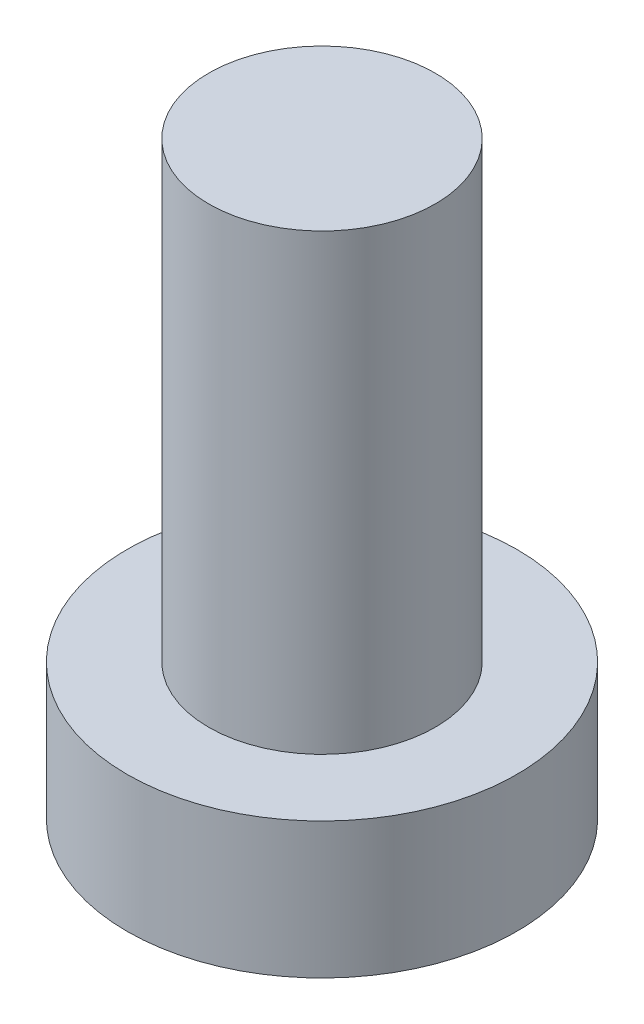
ISO-10303-21;
HEADER;
FILE_DESCRIPTION(('STEP AP214'),'2;1');
FILE_NAME('part.step','',(''),(''),'','','');
FILE_SCHEMA(('AUTOMOTIVE_DESIGN { 1 0 10303 214 1 1 1 1 }'));
ENDSEC;
DATA;
#1=APPLICATION_CONTEXT('core data for automotive mechanical design processes');
#2=APPLICATION_PROTOCOL_DEFINITION('international standard','automotive_design',2000,#1);
#3=PRODUCT_CONTEXT('',#1,'mechanical');
#4=PRODUCT('Part','Part','',(#3));
#5=PRODUCT_RELATED_PRODUCT_CATEGORY('part','',(#4));
#6=PRODUCT_DEFINITION_FORMATION('','',#4);
#7=PRODUCT_DEFINITION_CONTEXT('part definition',#1,'design');
#8=PRODUCT_DEFINITION('design','',#6,#7);
#9=PRODUCT_DEFINITION_SHAPE('','',#8);
#10=(LENGTH_UNIT() NAMED_UNIT(*) SI_UNIT(.MILLI.,.METRE.));
#11=(NAMED_UNIT(*) PLANE_ANGLE_UNIT() SI_UNIT($,.RADIAN.));
#12=(NAMED_UNIT(*) SI_UNIT($,.STERADIAN.) SOLID_ANGLE_UNIT());
#13=UNCERTAINTY_MEASURE_WITH_UNIT(LENGTH_MEASURE(1.E-05),#10,'distance_accuracy_value','');
#14=(GEOMETRIC_REPRESENTATION_CONTEXT(3) GLOBAL_UNCERTAINTY_ASSIGNED_CONTEXT((#13)) GLOBAL_UNIT_ASSIGNED_CONTEXT((#10,
#11,#12)) REPRESENTATION_CONTEXT('',''));
#15=CARTESIAN_POINT('',(0.,0.,0.));
#16=DIRECTION('',(0.,0.,1.));
#17=DIRECTION('',(1.,0.,0.));
#18=AXIS2_PLACEMENT_3D('',#15,#16,#17);
#19=CARTESIAN_POINT('',(0.,0.,0.));
#20=DIRECTION('',(0.,1.,0.));
#21=DIRECTION('',(0.,0.,1.));
#22=AXIS2_PLACEMENT_3D('',#19,#20,#21);
#23=PLANE('',#22);
#24=CARTESIAN_POINT('',(0.,0.,0.));
#25=DIRECTION('',(0.,1.,0.));
#26=DIRECTION('',(0.,0.,1.));
#27=AXIS2_PLACEMENT_3D('',#24,#25,#26);
#28=CIRCLE('',#27,4.3);
#29=CARTESIAN_POINT('',(0.,0.,4.3));
#30=VERTEX_POINT('',#29);
#31=EDGE_CURVE('E39',#30,#30,#28,.T.);
#32=ORIENTED_EDGE('',*,*,#31,.F.);
#33=EDGE_LOOP('',(#32));
#34=FACE_BOUND('',#33,.T.);
#35=CARTESIAN_POINT('',(1.1,0.,1.1));
#36=DIRECTION('',(0.,1.,0.));
#37=DIRECTION('',(0.,0.,-1.));
#38=AXIS2_PLACEMENT_3D('',#35,#36,#37);
#39=CIRCLE('',#38,0.5);
#40=CARTESIAN_POINT('',(1.1,0.,0.6));
#41=VERTEX_POINT('',#40);
#42=CARTESIAN_POINT('',(0.6,0.,1.1));
#43=VERTEX_POINT('',#42);
#44=EDGE_CURVE('E186',#41,#43,#39,.T.);
#45=ORIENTED_EDGE('',*,*,#44,.F.);
#46=DIRECTION('',(-1.,0.,0.));
#47=VECTOR('',#46,1.);
#48=CARTESIAN_POINT('',(1.1,0.,0.6));
#49=LINE('',#48,#47);
#50=CARTESIAN_POINT('',(2.4,0.,0.6));
#51=VERTEX_POINT('',#50);
#52=EDGE_CURVE('E52',#51,#41,#49,.T.);
#53=ORIENTED_EDGE('',*,*,#52,.F.);
#54=DIRECTION('',(0.,0.,1.));
#55=VECTOR('',#54,1.);
#56=CARTESIAN_POINT('',(2.4,0.,-0.6));
#57=LINE('',#56,#55);
#58=CARTESIAN_POINT('',(2.4,0.,-0.6));
#59=VERTEX_POINT('',#58);
#60=EDGE_CURVE('E225',#59,#51,#57,.T.);
#61=ORIENTED_EDGE('',*,*,#60,.F.);
#62=DIRECTION('',(1.,0.,0.));
#63=VECTOR('',#62,1.);
#64=CARTESIAN_POINT('',(1.1,0.,-0.6));
#65=LINE('',#64,#63);
#66=CARTESIAN_POINT('',(1.1,0.,-0.6));
#67=VERTEX_POINT('',#66);
#68=EDGE_CURVE('E223',#67,#59,#65,.T.);
#69=ORIENTED_EDGE('',*,*,#68,.F.);
#70=CARTESIAN_POINT('',(1.1,0.,-1.1));
#71=DIRECTION('',(0.,1.,0.));
#72=DIRECTION('',(0.,0.,-1.));
#73=AXIS2_PLACEMENT_3D('',#70,#71,#72);
#74=CIRCLE('',#73,0.5);
#75=CARTESIAN_POINT('',(0.600000000000001,0.,-1.1));
#76=VERTEX_POINT('',#75);
#77=EDGE_CURVE('E160',#76,#67,#74,.T.);
#78=ORIENTED_EDGE('',*,*,#77,.F.);
#79=DIRECTION('',(0.,0.,1.));
#80=VECTOR('',#79,1.);
#81=CARTESIAN_POINT('',(0.600000000000001,0.,-2.4));
#82=LINE('',#81,#80);
#83=CARTESIAN_POINT('',(0.600000000000001,0.,-2.4));
#84=VERTEX_POINT('',#83);
#85=EDGE_CURVE('E219',#84,#76,#82,.T.);
#86=ORIENTED_EDGE('',*,*,#85,.F.);
#87=DIRECTION('',(1.,0.,0.));
#88=VECTOR('',#87,1.);
#89=CARTESIAN_POINT('',(-0.599999999999999,0.,-2.4));
#90=LINE('',#89,#88);
#91=CARTESIAN_POINT('',(-0.599999999999999,0.,-2.4));
#92=VERTEX_POINT('',#91);
#93=EDGE_CURVE('E216',#92,#84,#90,.T.);
#94=ORIENTED_EDGE('',*,*,#93,.F.);
#95=DIRECTION('',(0.,0.,-1.));
#96=VECTOR('',#95,1.);
#97=CARTESIAN_POINT('',(-0.599999999999999,0.,-2.4));
#98=LINE('',#97,#96);
#99=CARTESIAN_POINT('',(-0.599999999999999,0.,-1.1));
#100=VERTEX_POINT('',#99);
#101=EDGE_CURVE('E213',#100,#92,#98,.T.);
#102=ORIENTED_EDGE('',*,*,#101,.F.);
#103=CARTESIAN_POINT('',(-1.1,0.,-1.1));
#104=DIRECTION('',(0.,1.,0.));
#105=DIRECTION('',(0.,0.,-1.));
#106=AXIS2_PLACEMENT_3D('',#103,#104,#105);
#107=CIRCLE('',#106,0.5);
#108=CARTESIAN_POINT('',(-1.1,0.,-0.6));
#109=VERTEX_POINT('',#108);
#110=EDGE_CURVE('E210',#109,#100,#107,.T.);
#111=ORIENTED_EDGE('',*,*,#110,.F.);
#112=DIRECTION('',(1.,0.,0.));
#113=VECTOR('',#112,1.);
#114=CARTESIAN_POINT('',(-2.4,0.,-0.6));
#115=LINE('',#114,#113);
#116=CARTESIAN_POINT('',(-2.4,0.,-0.6));
#117=VERTEX_POINT('',#116);
#118=EDGE_CURVE('E207',#117,#109,#115,.T.);
#119=ORIENTED_EDGE('',*,*,#118,.F.);
#120=DIRECTION('',(0.,0.,-1.));
#121=VECTOR('',#120,1.);
#122=CARTESIAN_POINT('',(-2.4,0.,-0.6));
#123=LINE('',#122,#121);
#124=CARTESIAN_POINT('',(-2.4,0.,0.6));
#125=VERTEX_POINT('',#124);
#126=EDGE_CURVE('E204',#125,#117,#123,.T.);
#127=ORIENTED_EDGE('',*,*,#126,.F.);
#128=DIRECTION('',(-1.,0.,0.));
#129=VECTOR('',#128,1.);
#130=CARTESIAN_POINT('',(-2.4,0.,0.6));
#131=LINE('',#130,#129);
#132=CARTESIAN_POINT('',(-1.1,0.,0.6));
#133=VERTEX_POINT('',#132);
#134=EDGE_CURVE('E201',#133,#125,#131,.T.);
#135=ORIENTED_EDGE('',*,*,#134,.F.);
#136=CARTESIAN_POINT('',(-1.1,0.,1.1));
#137=DIRECTION('',(0.,1.,0.));
#138=DIRECTION('',(0.,0.,1.));
#139=AXIS2_PLACEMENT_3D('',#136,#137,#138);
#140=CIRCLE('',#139,0.5);
#141=CARTESIAN_POINT('',(-0.599999999999999,0.,1.1));
#142=VERTEX_POINT('',#141);
#143=EDGE_CURVE('E198',#142,#133,#140,.T.);
#144=ORIENTED_EDGE('',*,*,#143,.F.);
#145=DIRECTION('',(0.,0.,-1.));
#146=VECTOR('',#145,1.);
#147=CARTESIAN_POINT('',(-0.599999999999999,0.,1.1));
#148=LINE('',#147,#146);
#149=CARTESIAN_POINT('',(-0.599999999999999,0.,2.4));
#150=VERTEX_POINT('',#149);
#151=EDGE_CURVE('E195',#150,#142,#148,.T.);
#152=ORIENTED_EDGE('',*,*,#151,.F.);
#153=DIRECTION('',(-1.,0.,0.));
#154=VECTOR('',#153,1.);
#155=CARTESIAN_POINT('',(-0.599999999999999,0.,2.4));
#156=LINE('',#155,#154);
#157=CARTESIAN_POINT('',(0.600000000000001,0.,2.4));
#158=VERTEX_POINT('',#157);
#159=EDGE_CURVE('E192',#158,#150,#156,.T.);
#160=ORIENTED_EDGE('',*,*,#159,.F.);
#161=DIRECTION('',(0.,0.,1.));
#162=VECTOR('',#161,1.);
#163=CARTESIAN_POINT('',(0.6,0.,1.1));
#164=LINE('',#163,#162);
#165=EDGE_CURVE('E189',#43,#158,#164,.T.);
#166=ORIENTED_EDGE('',*,*,#165,.F.);
#167=EDGE_LOOP('',(#45,#53,#61,#69,#78,#86,#94,#102,#111,#119,#127,#135,#144,#152,#160,#166));
#168=FACE_BOUND('',#167,.T.);
#169=ADVANCED_FACE('F35',(#34,#168),#23,.F.);
#170=CARTESIAN_POINT('',(0.,3.,0.));
#171=DIRECTION('',(0.,-1.,0.));
#172=DIRECTION('',(0.,0.,-1.));
#173=AXIS2_PLACEMENT_3D('',#170,#171,#172);
#174=CYLINDRICAL_SURFACE('',#173,4.3);
#175=CARTESIAN_POINT('',(0.,3.,0.));
#176=DIRECTION('',(0.,1.,0.));
#177=DIRECTION('',(0.,0.,1.));
#178=AXIS2_PLACEMENT_3D('',#175,#176,#177);
#179=CIRCLE('',#178,4.3);
#180=CARTESIAN_POINT('',(0.,3.,4.3));
#181=VERTEX_POINT('',#180);
#182=EDGE_CURVE('E44',#181,#181,#179,.T.);
#183=ORIENTED_EDGE('',*,*,#182,.F.);
#184=EDGE_LOOP('',(#183));
#185=FACE_BOUND('',#184,.T.);
#186=ORIENTED_EDGE('',*,*,#31,.T.);
#187=EDGE_LOOP('',(#186));
#188=FACE_BOUND('',#187,.T.);
#189=ADVANCED_FACE('F37',(#185,#188),#174,.T.);
#190=CARTESIAN_POINT('',(0.,3.,0.));
#191=DIRECTION('',(0.,1.,0.));
#192=DIRECTION('',(0.,0.,1.));
#193=AXIS2_PLACEMENT_3D('',#190,#191,#192);
#194=PLANE('',#193);
#195=CARTESIAN_POINT('',(0.,3.,0.));
#196=DIRECTION('',(0.,1.,0.));
#197=DIRECTION('',(0.,0.,1.));
#198=AXIS2_PLACEMENT_3D('',#195,#196,#197);
#199=CIRCLE('',#198,2.5);
#200=CARTESIAN_POINT('',(0.,3.,2.5));
#201=VERTEX_POINT('',#200);
#202=EDGE_CURVE('E11',#201,#201,#199,.T.);
#203=ORIENTED_EDGE('',*,*,#202,.F.);
#204=EDGE_LOOP('',(#203));
#205=FACE_BOUND('',#204,.T.);
#206=ORIENTED_EDGE('',*,*,#182,.T.);
#207=EDGE_LOOP('',(#206));
#208=FACE_BOUND('',#207,.T.);
#209=ADVANCED_FACE('F374',(#205,#208),#194,.T.);
#210=CARTESIAN_POINT('',(0.,13.,0.));
#211=DIRECTION('',(0.,-1.,0.));
#212=DIRECTION('',(0.,0.,-1.));
#213=AXIS2_PLACEMENT_3D('',#210,#211,#212);
#214=CYLINDRICAL_SURFACE('',#213,2.5);
#215=CARTESIAN_POINT('',(0.,13.,0.));
#216=DIRECTION('',(0.,1.,0.));
#217=DIRECTION('',(0.,0.,1.));
#218=AXIS2_PLACEMENT_3D('',#215,#216,#217);
#219=CIRCLE('',#218,2.5);
#220=CARTESIAN_POINT('',(0.,13.,2.5));
#221=VERTEX_POINT('',#220);
#222=EDGE_CURVE('E229',#221,#221,#219,.T.);
#223=ORIENTED_EDGE('',*,*,#222,.F.);
#224=EDGE_LOOP('',(#223));
#225=FACE_BOUND('',#224,.T.);
#226=ORIENTED_EDGE('',*,*,#202,.T.);
#227=EDGE_LOOP('',(#226));
#228=FACE_BOUND('',#227,.T.);
#229=ADVANCED_FACE('F370',(#225,#228),#214,.T.);
#230=CARTESIAN_POINT('',(0.,13.,0.));
#231=DIRECTION('',(0.,1.,0.));
#232=DIRECTION('',(0.,0.,1.));
#233=AXIS2_PLACEMENT_3D('',#230,#231,#232);
#234=PLANE('',#233);
#235=ORIENTED_EDGE('',*,*,#222,.T.);
#236=EDGE_LOOP('',(#235));
#237=FACE_BOUND('',#236,.T.);
#238=ADVANCED_FACE('F320',(#237),#234,.T.);
#239=CARTESIAN_POINT('',(1.1,1.5,0.6));
#240=DIRECTION('',(0.,0.,1.));
#241=DIRECTION('',(1.,0.,0.));
#242=AXIS2_PLACEMENT_3D('',#239,#240,#241);
#243=PLANE('',#242);
#244=ORIENTED_EDGE('',*,*,#52,.T.);
#245=DIRECTION('',(0.,-1.,0.));
#246=VECTOR('',#245,1.);
#247=CARTESIAN_POINT('',(1.1,1.5,0.6));
#248=LINE('',#247,#246);
#249=CARTESIAN_POINT('',(1.1,1.5,0.6));
#250=VERTEX_POINT('',#249);
#251=EDGE_CURVE('E112',#250,#41,#248,.T.);
#252=ORIENTED_EDGE('',*,*,#251,.F.);
#253=DIRECTION('',(-1.,0.,0.));
#254=VECTOR('',#253,1.);
#255=CARTESIAN_POINT('',(1.1,1.5,0.6));
#256=LINE('',#255,#254);
#257=CARTESIAN_POINT('',(2.4,1.5,0.6));
#258=VERTEX_POINT('',#257);
#259=EDGE_CURVE('E227',#258,#250,#256,.T.);
#260=ORIENTED_EDGE('',*,*,#259,.F.);
#261=DIRECTION('',(0.,-1.,0.));
#262=VECTOR('',#261,1.);
#263=CARTESIAN_POINT('',(2.4,1.5,0.6));
#264=LINE('',#263,#262);
#265=EDGE_CURVE('E60',#258,#51,#264,.T.);
#266=ORIENTED_EDGE('',*,*,#265,.T.);
#267=EDGE_LOOP('',(#244,#252,#260,#266));
#268=FACE_BOUND('',#267,.T.);
#269=ADVANCED_FACE('F313',(#268),#243,.F.);
#270=CARTESIAN_POINT('',(2.4,1.5,-0.6));
#271=DIRECTION('',(1.,0.,0.));
#272=DIRECTION('',(0.,0.,-1.));
#273=AXIS2_PLACEMENT_3D('',#270,#271,#272);
#274=PLANE('',#273);
#275=ORIENTED_EDGE('',*,*,#60,.T.);
#276=ORIENTED_EDGE('',*,*,#265,.F.);
#277=DIRECTION('',(0.,0.,1.));
#278=VECTOR('',#277,1.);
#279=CARTESIAN_POINT('',(2.4,1.5,-0.6));
#280=LINE('',#279,#278);
#281=CARTESIAN_POINT('',(2.4,1.5,-0.6));
#282=VERTEX_POINT('',#281);
#283=EDGE_CURVE('E172',#282,#258,#280,.T.);
#284=ORIENTED_EDGE('',*,*,#283,.F.);
#285=DIRECTION('',(0.,-1.,0.));
#286=VECTOR('',#285,1.);
#287=CARTESIAN_POINT('',(2.4,1.5,-0.6));
#288=LINE('',#287,#286);
#289=EDGE_CURVE('E164',#282,#59,#288,.T.);
#290=ORIENTED_EDGE('',*,*,#289,.T.);
#291=EDGE_LOOP('',(#275,#276,#284,#290));
#292=FACE_BOUND('',#291,.T.);
#293=ADVANCED_FACE('F311',(#292),#274,.F.);
#294=CARTESIAN_POINT('',(1.1,1.5,-0.6));
#295=DIRECTION('',(0.,0.,-1.));
#296=DIRECTION('',(-1.,0.,0.));
#297=AXIS2_PLACEMENT_3D('',#294,#295,#296);
#298=PLANE('',#297);
#299=ORIENTED_EDGE('',*,*,#68,.T.);
#300=ORIENTED_EDGE('',*,*,#289,.F.);
#301=DIRECTION('',(1.,0.,0.));
#302=VECTOR('',#301,1.);
#303=CARTESIAN_POINT('',(1.1,1.5,-0.6));
#304=LINE('',#303,#302);
#305=CARTESIAN_POINT('',(1.1,1.5,-0.6));
#306=VERTEX_POINT('',#305);
#307=EDGE_CURVE('E168',#306,#282,#304,.T.);
#308=ORIENTED_EDGE('',*,*,#307,.F.);
#309=DIRECTION('',(0.,-1.,0.));
#310=VECTOR('',#309,1.);
#311=CARTESIAN_POINT('',(1.1,1.5,-0.6));
#312=LINE('',#311,#310);
#313=EDGE_CURVE('E153',#306,#67,#312,.T.);
#314=ORIENTED_EDGE('',*,*,#313,.T.);
#315=EDGE_LOOP('',(#299,#300,#308,#314));
#316=FACE_BOUND('',#315,.T.);
#317=ADVANCED_FACE('F169',(#316),#298,.F.);
#318=CARTESIAN_POINT('',(1.1,1.5,-1.1));
#319=DIRECTION('',(0.,-1.,0.));
#320=DIRECTION('',(0.,0.,-1.));
#321=AXIS2_PLACEMENT_3D('',#318,#319,#320);
#322=CYLINDRICAL_SURFACE('',#321,0.5);
#323=ORIENTED_EDGE('',*,*,#77,.T.);
#324=ORIENTED_EDGE('',*,*,#313,.F.);
#325=CARTESIAN_POINT('',(1.1,1.5,-1.1));
#326=DIRECTION('',(0.,1.,0.));
#327=DIRECTION('',(0.,0.,-1.));
#328=AXIS2_PLACEMENT_3D('',#325,#326,#327);
#329=CIRCLE('',#328,0.5);
#330=CARTESIAN_POINT('',(0.600000000000001,1.5,-1.1));
#331=VERTEX_POINT('',#330);
#332=EDGE_CURVE('E157',#331,#306,#329,.T.);
#333=ORIENTED_EDGE('',*,*,#332,.F.);
#334=DIRECTION('',(0.,-1.,0.));
#335=VECTOR('',#334,1.);
#336=CARTESIAN_POINT('',(0.600000000000001,1.5,-1.1));
#337=LINE('',#336,#335);
#338=EDGE_CURVE('E165',#331,#76,#337,.T.);
#339=ORIENTED_EDGE('',*,*,#338,.T.);
#340=EDGE_LOOP('',(#323,#324,#333,#339));
#341=FACE_BOUND('',#340,.T.);
#342=ADVANCED_FACE('F155',(#341),#322,.T.);
#343=CARTESIAN_POINT('',(0.600000000000001,1.5,-2.4));
#344=DIRECTION('',(1.,0.,0.));
#345=DIRECTION('',(0.,0.,-1.));
#346=AXIS2_PLACEMENT_3D('',#343,#344,#345);
#347=PLANE('',#346);
#348=ORIENTED_EDGE('',*,*,#85,.T.);
#349=ORIENTED_EDGE('',*,*,#338,.F.);
#350=DIRECTION('',(0.,0.,1.));
#351=VECTOR('',#350,1.);
#352=CARTESIAN_POINT('',(0.600000000000001,1.5,-2.4));
#353=LINE('',#352,#351);
#354=CARTESIAN_POINT('',(0.600000000000001,1.5,-2.4));
#355=VERTEX_POINT('',#354);
#356=EDGE_CURVE('E178',#355,#331,#353,.T.);
#357=ORIENTED_EDGE('',*,*,#356,.F.);
#358=DIRECTION('',(0.,-1.,0.));
#359=VECTOR('',#358,1.);
#360=CARTESIAN_POINT('',(0.600000000000001,1.5,-2.4));
#361=LINE('',#360,#359);
#362=EDGE_CURVE('E232',#355,#84,#361,.T.);
#363=ORIENTED_EDGE('',*,*,#362,.T.);
#364=EDGE_LOOP('',(#348,#349,#357,#363));
#365=FACE_BOUND('',#364,.T.);
#366=ADVANCED_FACE('F310',(#365),#347,.F.);
#367=CARTESIAN_POINT('',(-0.599999999999999,1.5,-2.4));
#368=DIRECTION('',(0.,0.,-1.));
#369=DIRECTION('',(-1.,0.,0.));
#370=AXIS2_PLACEMENT_3D('',#367,#368,#369);
#371=PLANE('',#370);
#372=ORIENTED_EDGE('',*,*,#93,.T.);
#373=ORIENTED_EDGE('',*,*,#362,.F.);
#374=DIRECTION('',(1.,0.,0.));
#375=VECTOR('',#374,1.);
#376=CARTESIAN_POINT('',(-0.599999999999999,1.5,-2.4));
#377=LINE('',#376,#375);
#378=CARTESIAN_POINT('',(-0.599999999999999,1.5,-2.4));
#379=VERTEX_POINT('',#378);
#380=EDGE_CURVE('E180',#379,#355,#377,.T.);
#381=ORIENTED_EDGE('',*,*,#380,.F.);
#382=DIRECTION('',(0.,-1.,0.));
#383=VECTOR('',#382,1.);
#384=CARTESIAN_POINT('',(-0.599999999999999,1.5,-2.4));
#385=LINE('',#384,#383);
#386=EDGE_CURVE('E234',#379,#92,#385,.T.);
#387=ORIENTED_EDGE('',*,*,#386,.T.);
#388=EDGE_LOOP('',(#372,#373,#381,#387));
#389=FACE_BOUND('',#388,.T.);
#390=ADVANCED_FACE('F306',(#389),#371,.F.);
#391=CARTESIAN_POINT('',(-0.599999999999999,1.5,-2.4));
#392=DIRECTION('',(-1.,0.,0.));
#393=DIRECTION('',(0.,0.,1.));
#394=AXIS2_PLACEMENT_3D('',#391,#392,#393);
#395=PLANE('',#394);
#396=ORIENTED_EDGE('',*,*,#101,.T.);
#397=ORIENTED_EDGE('',*,*,#386,.F.);
#398=DIRECTION('',(0.,0.,-1.));
#399=VECTOR('',#398,1.);
#400=CARTESIAN_POINT('',(-0.599999999999999,1.5,-2.4));
#401=LINE('',#400,#399);
#402=CARTESIAN_POINT('',(-0.599999999999999,1.5,-1.1));
#403=VERTEX_POINT('',#402);
#404=EDGE_CURVE('E301',#403,#379,#401,.T.);
#405=ORIENTED_EDGE('',*,*,#404,.F.);
#406=DIRECTION('',(0.,-1.,0.));
#407=VECTOR('',#406,1.);
#408=CARTESIAN_POINT('',(-0.599999999999999,1.5,-1.1));
#409=LINE('',#408,#407);
#410=EDGE_CURVE('E236',#403,#100,#409,.T.);
#411=ORIENTED_EDGE('',*,*,#410,.T.);
#412=EDGE_LOOP('',(#396,#397,#405,#411));
#413=FACE_BOUND('',#412,.T.);
#414=ADVANCED_FACE('F330',(#413),#395,.F.);
#415=CARTESIAN_POINT('',(-1.1,1.5,-1.1));
#416=DIRECTION('',(0.,-1.,0.));
#417=DIRECTION('',(0.,0.,-1.));
#418=AXIS2_PLACEMENT_3D('',#415,#416,#417);
#419=CYLINDRICAL_SURFACE('',#418,0.5);
#420=ORIENTED_EDGE('',*,*,#110,.T.);
#421=ORIENTED_EDGE('',*,*,#410,.F.);
#422=CARTESIAN_POINT('',(-1.1,1.5,-1.1));
#423=DIRECTION('',(0.,1.,0.));
#424=DIRECTION('',(0.,0.,-1.));
#425=AXIS2_PLACEMENT_3D('',#422,#423,#424);
#426=CIRCLE('',#425,0.5);
#427=CARTESIAN_POINT('',(-1.1,1.5,-0.6));
#428=VERTEX_POINT('',#427);
#429=EDGE_CURVE('E298',#428,#403,#426,.T.);
#430=ORIENTED_EDGE('',*,*,#429,.F.);
#431=DIRECTION('',(0.,-1.,0.));
#432=VECTOR('',#431,1.);
#433=CARTESIAN_POINT('',(-1.1,1.5,-0.6));
#434=LINE('',#433,#432);
#435=EDGE_CURVE('E238',#428,#109,#434,.T.);
#436=ORIENTED_EDGE('',*,*,#435,.T.);
#437=EDGE_LOOP('',(#420,#421,#430,#436));
#438=FACE_BOUND('',#437,.T.);
#439=ADVANCED_FACE('F333',(#438),#419,.T.);
#440=CARTESIAN_POINT('',(-2.4,1.5,-0.6));
#441=DIRECTION('',(0.,0.,-1.));
#442=DIRECTION('',(-1.,0.,0.));
#443=AXIS2_PLACEMENT_3D('',#440,#441,#442);
#444=PLANE('',#443);
#445=ORIENTED_EDGE('',*,*,#118,.T.);
#446=ORIENTED_EDGE('',*,*,#435,.F.);
#447=DIRECTION('',(1.,0.,0.));
#448=VECTOR('',#447,1.);
#449=CARTESIAN_POINT('',(-2.4,1.5,-0.6));
#450=LINE('',#449,#448);
#451=CARTESIAN_POINT('',(-2.4,1.5,-0.6));
#452=VERTEX_POINT('',#451);
#453=EDGE_CURVE('E295',#452,#428,#450,.T.);
#454=ORIENTED_EDGE('',*,*,#453,.F.);
#455=DIRECTION('',(0.,-1.,0.));
#456=VECTOR('',#455,1.);
#457=CARTESIAN_POINT('',(-2.4,1.5,-0.6));
#458=LINE('',#457,#456);
#459=EDGE_CURVE('E240',#452,#117,#458,.T.);
#460=ORIENTED_EDGE('',*,*,#459,.T.);
#461=EDGE_LOOP('',(#445,#446,#454,#460));
#462=FACE_BOUND('',#461,.T.);
#463=ADVANCED_FACE('F337',(#462),#444,.F.);
#464=CARTESIAN_POINT('',(-2.4,1.5,-0.6));
#465=DIRECTION('',(-1.,0.,0.));
#466=DIRECTION('',(0.,0.,1.));
#467=AXIS2_PLACEMENT_3D('',#464,#465,#466);
#468=PLANE('',#467);
#469=ORIENTED_EDGE('',*,*,#126,.T.);
#470=ORIENTED_EDGE('',*,*,#459,.F.);
#471=DIRECTION('',(0.,0.,-1.));
#472=VECTOR('',#471,1.);
#473=CARTESIAN_POINT('',(-2.4,1.5,-0.6));
#474=LINE('',#473,#472);
#475=CARTESIAN_POINT('',(-2.4,1.5,0.6));
#476=VERTEX_POINT('',#475);
#477=EDGE_CURVE('E292',#476,#452,#474,.T.);
#478=ORIENTED_EDGE('',*,*,#477,.F.);
#479=DIRECTION('',(0.,-1.,0.));
#480=VECTOR('',#479,1.);
#481=CARTESIAN_POINT('',(-2.4,1.5,0.6));
#482=LINE('',#481,#480);
#483=EDGE_CURVE('E242',#476,#125,#482,.T.);
#484=ORIENTED_EDGE('',*,*,#483,.T.);
#485=EDGE_LOOP('',(#469,#470,#478,#484));
#486=FACE_BOUND('',#485,.T.);
#487=ADVANCED_FACE('F341',(#486),#468,.F.);
#488=CARTESIAN_POINT('',(-2.4,1.5,0.6));
#489=DIRECTION('',(0.,0.,1.));
#490=DIRECTION('',(1.,0.,0.));
#491=AXIS2_PLACEMENT_3D('',#488,#489,#490);
#492=PLANE('',#491);
#493=ORIENTED_EDGE('',*,*,#134,.T.);
#494=ORIENTED_EDGE('',*,*,#483,.F.);
#495=DIRECTION('',(-1.,0.,0.));
#496=VECTOR('',#495,1.);
#497=CARTESIAN_POINT('',(-2.4,1.5,0.6));
#498=LINE('',#497,#496);
#499=CARTESIAN_POINT('',(-1.1,1.5,0.6));
#500=VERTEX_POINT('',#499);
#501=EDGE_CURVE('E289',#500,#476,#498,.T.);
#502=ORIENTED_EDGE('',*,*,#501,.F.);
#503=DIRECTION('',(0.,-1.,0.));
#504=VECTOR('',#503,1.);
#505=CARTESIAN_POINT('',(-1.1,1.5,0.6));
#506=LINE('',#505,#504);
#507=EDGE_CURVE('E244',#500,#133,#506,.T.);
#508=ORIENTED_EDGE('',*,*,#507,.T.);
#509=EDGE_LOOP('',(#493,#494,#502,#508));
#510=FACE_BOUND('',#509,.T.);
#511=ADVANCED_FACE('F345',(#510),#492,.F.);
#512=CARTESIAN_POINT('',(-1.1,1.5,1.1));
#513=DIRECTION('',(0.,-1.,0.));
#514=DIRECTION('',(0.,0.,-1.));
#515=AXIS2_PLACEMENT_3D('',#512,#513,#514);
#516=CYLINDRICAL_SURFACE('',#515,0.5);
#517=ORIENTED_EDGE('',*,*,#143,.T.);
#518=ORIENTED_EDGE('',*,*,#507,.F.);
#519=CARTESIAN_POINT('',(-1.1,1.5,1.1));
#520=DIRECTION('',(0.,1.,0.));
#521=DIRECTION('',(0.,0.,1.));
#522=AXIS2_PLACEMENT_3D('',#519,#520,#521);
#523=CIRCLE('',#522,0.5);
#524=CARTESIAN_POINT('',(-0.599999999999999,1.5,1.1));
#525=VERTEX_POINT('',#524);
#526=EDGE_CURVE('E286',#525,#500,#523,.T.);
#527=ORIENTED_EDGE('',*,*,#526,.F.);
#528=DIRECTION('',(0.,-1.,0.));
#529=VECTOR('',#528,1.);
#530=CARTESIAN_POINT('',(-0.599999999999999,1.5,1.1));
#531=LINE('',#530,#529);
#532=EDGE_CURVE('E246',#525,#142,#531,.T.);
#533=ORIENTED_EDGE('',*,*,#532,.T.);
#534=EDGE_LOOP('',(#517,#518,#527,#533));
#535=FACE_BOUND('',#534,.T.);
#536=ADVANCED_FACE('F349',(#535),#516,.T.);
#537=CARTESIAN_POINT('',(-0.599999999999999,1.5,1.1));
#538=DIRECTION('',(-1.,0.,0.));
#539=DIRECTION('',(0.,0.,1.));
#540=AXIS2_PLACEMENT_3D('',#537,#538,#539);
#541=PLANE('',#540);
#542=ORIENTED_EDGE('',*,*,#151,.T.);
#543=ORIENTED_EDGE('',*,*,#532,.F.);
#544=DIRECTION('',(0.,0.,-1.));
#545=VECTOR('',#544,1.);
#546=CARTESIAN_POINT('',(-0.599999999999999,1.5,1.1));
#547=LINE('',#546,#545);
#548=CARTESIAN_POINT('',(-0.599999999999999,1.5,2.4));
#549=VERTEX_POINT('',#548);
#550=EDGE_CURVE('E283',#549,#525,#547,.T.);
#551=ORIENTED_EDGE('',*,*,#550,.F.);
#552=DIRECTION('',(0.,-1.,0.));
#553=VECTOR('',#552,1.);
#554=CARTESIAN_POINT('',(-0.599999999999999,1.5,2.4));
#555=LINE('',#554,#553);
#556=EDGE_CURVE('E248',#549,#150,#555,.T.);
#557=ORIENTED_EDGE('',*,*,#556,.T.);
#558=EDGE_LOOP('',(#542,#543,#551,#557));
#559=FACE_BOUND('',#558,.T.);
#560=ADVANCED_FACE('F353',(#559),#541,.F.);
#561=CARTESIAN_POINT('',(-0.599999999999999,1.5,2.4));
#562=DIRECTION('',(0.,0.,1.));
#563=DIRECTION('',(1.,0.,0.));
#564=AXIS2_PLACEMENT_3D('',#561,#562,#563);
#565=PLANE('',#564);
#566=ORIENTED_EDGE('',*,*,#159,.T.);
#567=ORIENTED_EDGE('',*,*,#556,.F.);
#568=DIRECTION('',(-1.,0.,0.));
#569=VECTOR('',#568,1.);
#570=CARTESIAN_POINT('',(-0.599999999999999,1.5,2.4));
#571=LINE('',#570,#569);
#572=CARTESIAN_POINT('',(0.600000000000001,1.5,2.4));
#573=VERTEX_POINT('',#572);
#574=EDGE_CURVE('E280',#573,#549,#571,.T.);
#575=ORIENTED_EDGE('',*,*,#574,.F.);
#576=DIRECTION('',(0.,-1.,0.));
#577=VECTOR('',#576,1.);
#578=CARTESIAN_POINT('',(0.600000000000001,1.5,2.4));
#579=LINE('',#578,#577);
#580=EDGE_CURVE('E250',#573,#158,#579,.T.);
#581=ORIENTED_EDGE('',*,*,#580,.T.);
#582=EDGE_LOOP('',(#566,#567,#575,#581));
#583=FACE_BOUND('',#582,.T.);
#584=ADVANCED_FACE('F357',(#583),#565,.F.);
#585=CARTESIAN_POINT('',(0.6,1.5,1.1));
#586=DIRECTION('',(1.,0.,0.));
#587=DIRECTION('',(0.,0.,-1.));
#588=AXIS2_PLACEMENT_3D('',#585,#586,#587);
#589=PLANE('',#588);
#590=ORIENTED_EDGE('',*,*,#165,.T.);
#591=ORIENTED_EDGE('',*,*,#580,.F.);
#592=DIRECTION('',(0.,0.,1.));
#593=VECTOR('',#592,1.);
#594=CARTESIAN_POINT('',(0.6,1.5,1.1));
#595=LINE('',#594,#593);
#596=CARTESIAN_POINT('',(0.6,1.5,1.1));
#597=VERTEX_POINT('',#596);
#598=EDGE_CURVE('E275',#597,#573,#595,.T.);
#599=ORIENTED_EDGE('',*,*,#598,.F.);
#600=DIRECTION('',(0.,-1.,0.));
#601=VECTOR('',#600,1.);
#602=CARTESIAN_POINT('',(0.6,1.5,1.1));
#603=LINE('',#602,#601);
#604=EDGE_CURVE('E252',#597,#43,#603,.T.);
#605=ORIENTED_EDGE('',*,*,#604,.T.);
#606=EDGE_LOOP('',(#590,#591,#599,#605));
#607=FACE_BOUND('',#606,.T.);
#608=ADVANCED_FACE('F361',(#607),#589,.F.);
#609=CARTESIAN_POINT('',(1.1,1.5,1.1));
#610=DIRECTION('',(0.,-1.,0.));
#611=DIRECTION('',(0.,0.,-1.));
#612=AXIS2_PLACEMENT_3D('',#609,#610,#611);
#613=CYLINDRICAL_SURFACE('',#612,0.5);
#614=ORIENTED_EDGE('',*,*,#44,.T.);
#615=ORIENTED_EDGE('',*,*,#604,.F.);
#616=CARTESIAN_POINT('',(1.1,1.5,1.1));
#617=DIRECTION('',(0.,1.,0.));
#618=DIRECTION('',(0.,0.,-1.));
#619=AXIS2_PLACEMENT_3D('',#616,#617,#618);
#620=CIRCLE('',#619,0.5);
#621=EDGE_CURVE('E273',#250,#597,#620,.T.);
#622=ORIENTED_EDGE('',*,*,#621,.F.);
#623=ORIENTED_EDGE('',*,*,#251,.T.);
#624=EDGE_LOOP('',(#614,#615,#622,#623));
#625=FACE_BOUND('',#624,.T.);
#626=ADVANCED_FACE('F270',(#625),#613,.T.);
#627=CARTESIAN_POINT('',(1.1,1.5,-1.1));
#628=DIRECTION('',(0.,-1.,0.));
#629=DIRECTION('',(0.,0.,-1.));
#630=AXIS2_PLACEMENT_3D('',#627,#628,#629);
#631=PLANE('',#630);
#632=ORIENTED_EDGE('',*,*,#259,.T.);
#633=ORIENTED_EDGE('',*,*,#621,.T.);
#634=ORIENTED_EDGE('',*,*,#598,.T.);
#635=ORIENTED_EDGE('',*,*,#574,.T.);
#636=ORIENTED_EDGE('',*,*,#550,.T.);
#637=ORIENTED_EDGE('',*,*,#526,.T.);
#638=ORIENTED_EDGE('',*,*,#501,.T.);
#639=ORIENTED_EDGE('',*,*,#477,.T.);
#640=ORIENTED_EDGE('',*,*,#453,.T.);
#641=ORIENTED_EDGE('',*,*,#429,.T.);
#642=ORIENTED_EDGE('',*,*,#404,.T.);
#643=ORIENTED_EDGE('',*,*,#380,.T.);
#644=ORIENTED_EDGE('',*,*,#356,.T.);
#645=ORIENTED_EDGE('',*,*,#332,.T.);
#646=ORIENTED_EDGE('',*,*,#307,.T.);
#647=ORIENTED_EDGE('',*,*,#283,.T.);
#648=EDGE_LOOP('',(#632,#633,#634,#635,#636,#637,#638,#639,#640,#641,#642,#643,#644,#645,#646,#647));
#649=FACE_BOUND('',#648,.T.);
#650=ADVANCED_FACE('F175',(#649),#631,.T.);
#651=CLOSED_SHELL('',(#169,#189,#209,#229,#238,#269,#293,#317,#342,#366,#390,#414,#439,#463,
#487,#511,#536,#560,#584,#608,#626,#650));
#652=MANIFOLD_SOLID_BREP('B2',#651);
#653=ADVANCED_BREP_SHAPE_REPRESENTATION('',(#18,#652),#14);
#654=SHAPE_DEFINITION_REPRESENTATION(#9,#653);
ENDSEC;
END-ISO-10303-21;
